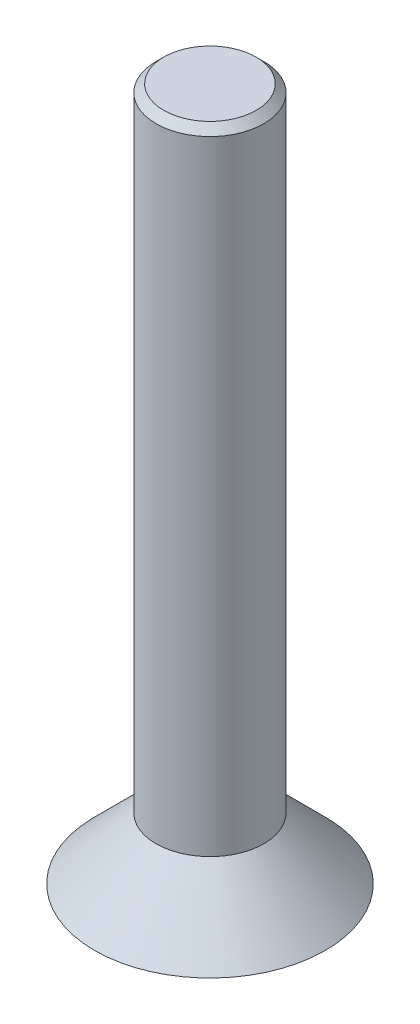
ISO-10303-21;
HEADER;
FILE_DESCRIPTION(('STEP AP214'),'2;1');
FILE_NAME('part.step','',(''),(''),'','','');
FILE_SCHEMA(('AUTOMOTIVE_DESIGN { 1 0 10303 214 1 1 1 1 }'));
ENDSEC;
DATA;
#1=APPLICATION_CONTEXT('core data for automotive mechanical design processes');
#2=APPLICATION_PROTOCOL_DEFINITION('international standard','automotive_design',2000,#1);
#3=PRODUCT_CONTEXT('',#1,'mechanical');
#4=PRODUCT('Part','Part','',(#3));
#5=PRODUCT_RELATED_PRODUCT_CATEGORY('part','',(#4));
#6=PRODUCT_DEFINITION_FORMATION('','',#4);
#7=PRODUCT_DEFINITION_CONTEXT('part definition',#1,'design');
#8=PRODUCT_DEFINITION('design','',#6,#7);
#9=PRODUCT_DEFINITION_SHAPE('','',#8);
#10=(LENGTH_UNIT() NAMED_UNIT(*) SI_UNIT(.MILLI.,.METRE.));
#11=(NAMED_UNIT(*) PLANE_ANGLE_UNIT() SI_UNIT($,.RADIAN.));
#12=(NAMED_UNIT(*) SI_UNIT($,.STERADIAN.) SOLID_ANGLE_UNIT());
#13=UNCERTAINTY_MEASURE_WITH_UNIT(LENGTH_MEASURE(1.E-05),#10,'distance_accuracy_value','');
#14=(GEOMETRIC_REPRESENTATION_CONTEXT(3) GLOBAL_UNCERTAINTY_ASSIGNED_CONTEXT((#13)) GLOBAL_UNIT_ASSIGNED_CONTEXT((#10,
#11,#12)) REPRESENTATION_CONTEXT('',''));
#15=CARTESIAN_POINT('',(0.,0.,0.));
#16=DIRECTION('',(0.,0.,1.));
#17=DIRECTION('',(1.,0.,0.));
#18=AXIS2_PLACEMENT_3D('',#15,#16,#17);
#19=CARTESIAN_POINT('',(0.,0.,0.));
#20=DIRECTION('',(0.,1.,0.));
#21=DIRECTION('',(0.,0.,1.));
#22=AXIS2_PLACEMENT_3D('',#19,#20,#21);
#23=PLANE('',#22);
#24=CARTESIAN_POINT('',(0.,0.,0.));
#25=DIRECTION('',(0.,1.,0.));
#26=DIRECTION('',(0.,0.,1.));
#27=AXIS2_PLACEMENT_3D('',#24,#25,#26);
#28=CIRCLE('',#27,3.);
#29=CARTESIAN_POINT('',(0.,0.,3.));
#30=VERTEX_POINT('',#29);
#31=EDGE_CURVE('E126',#30,#30,#28,.T.);
#32=ORIENTED_EDGE('',*,*,#31,.F.);
#33=EDGE_LOOP('',(#32));
#34=FACE_BOUND('',#33,.T.);
#35=DIRECTION('',(0.866025403784439,0.,0.5));
#36=VECTOR('',#35,1.);
#37=CARTESIAN_POINT('',(-1.,0.,0.577350269189626));
#38=LINE('',#37,#36);
#39=CARTESIAN_POINT('',(-1.,0.,0.577350269189626));
#40=VERTEX_POINT('',#39);
#41=CARTESIAN_POINT('',(0.,0.,1.15470053837925));
#42=VERTEX_POINT('',#41);
#43=EDGE_CURVE('E55',#40,#42,#38,.T.);
#44=ORIENTED_EDGE('',*,*,#43,.T.);
#45=DIRECTION('',(0.866025403784438,0.,-0.5));
#46=VECTOR('',#45,1.);
#47=CARTESIAN_POINT('',(0.,0.,1.15470053837925));
#48=LINE('',#47,#46);
#49=CARTESIAN_POINT('',(1.,0.,0.577350269189626));
#50=VERTEX_POINT('',#49);
#51=EDGE_CURVE('E111',#42,#50,#48,.T.);
#52=ORIENTED_EDGE('',*,*,#51,.T.);
#53=DIRECTION('',(0.,0.,-1.));
#54=VECTOR('',#53,1.);
#55=CARTESIAN_POINT('',(1.,0.,0.577350269189626));
#56=LINE('',#55,#54);
#57=CARTESIAN_POINT('',(0.999999999999999,0.,-0.577350269189626));
#58=VERTEX_POINT('',#57);
#59=EDGE_CURVE('E109',#50,#58,#56,.T.);
#60=ORIENTED_EDGE('',*,*,#59,.T.);
#61=DIRECTION('',(-0.866025403784439,0.,-0.5));
#62=VECTOR('',#61,1.);
#63=CARTESIAN_POINT('',(0.999999999999999,0.,-0.577350269189626));
#64=LINE('',#63,#62);
#65=CARTESIAN_POINT('',(0.,0.,-1.15470053837925));
#66=VERTEX_POINT('',#65);
#67=EDGE_CURVE('E90',#58,#66,#64,.T.);
#68=ORIENTED_EDGE('',*,*,#67,.T.);
#69=DIRECTION('',(-0.866025403784438,0.,0.5));
#70=VECTOR('',#69,1.);
#71=CARTESIAN_POINT('',(0.,0.,-1.15470053837925));
#72=LINE('',#71,#70);
#73=CARTESIAN_POINT('',(-1.,0.,-0.577350269189625));
#74=VERTEX_POINT('',#73);
#75=EDGE_CURVE('E99',#66,#74,#72,.T.);
#76=ORIENTED_EDGE('',*,*,#75,.T.);
#77=DIRECTION('',(0.,0.,1.));
#78=VECTOR('',#77,1.);
#79=CARTESIAN_POINT('',(-1.,0.,-0.577350269189625));
#80=LINE('',#79,#78);
#81=EDGE_CURVE('E105',#74,#40,#80,.T.);
#82=ORIENTED_EDGE('',*,*,#81,.T.);
#83=EDGE_LOOP('',(#44,#52,#60,#68,#76,#82));
#84=FACE_BOUND('',#83,.T.);
#85=ADVANCED_FACE('F39',(#34,#84),#23,.F.);
#86=CARTESIAN_POINT('',(-1.,1.6,0.577350269189626));
#87=DIRECTION('',(0.5,0.,-0.866025403784439));
#88=DIRECTION('',(-0.866025403784439,0.,-0.5));
#89=AXIS2_PLACEMENT_3D('',#86,#87,#88);
#90=PLANE('',#89);
#91=ORIENTED_EDGE('',*,*,#43,.F.);
#92=DIRECTION('',(0.,-1.,0.));
#93=VECTOR('',#92,1.);
#94=CARTESIAN_POINT('',(-1.,1.6,0.577350269189626));
#95=LINE('',#94,#93);
#96=CARTESIAN_POINT('',(-1.,1.6,0.577350269189626));
#97=VERTEX_POINT('',#96);
#98=EDGE_CURVE('E117',#97,#40,#95,.T.);
#99=ORIENTED_EDGE('',*,*,#98,.F.);
#100=DIRECTION('',(0.866025403784439,0.,0.5));
#101=VECTOR('',#100,1.);
#102=CARTESIAN_POINT('',(-1.,1.6,0.577350269189626));
#103=LINE('',#102,#101);
#104=CARTESIAN_POINT('',(0.,1.6,1.15470053837925));
#105=VERTEX_POINT('',#104);
#106=EDGE_CURVE('E116',#97,#105,#103,.T.);
#107=ORIENTED_EDGE('',*,*,#106,.T.);
#108=DIRECTION('',(0.,-1.,0.));
#109=VECTOR('',#108,1.);
#110=CARTESIAN_POINT('',(0.,1.6,1.15470053837925));
#111=LINE('',#110,#109);
#112=EDGE_CURVE('E124',#105,#42,#111,.T.);
#113=ORIENTED_EDGE('',*,*,#112,.T.);
#114=EDGE_LOOP('',(#91,#99,#107,#113));
#115=FACE_BOUND('',#114,.T.);
#116=ADVANCED_FACE('F145',(#115),#90,.T.);
#117=CARTESIAN_POINT('',(0.,1.6,1.15470053837925));
#118=DIRECTION('',(-0.5,0.,-0.866025403784438));
#119=DIRECTION('',(-0.866025403784439,0.,0.5));
#120=AXIS2_PLACEMENT_3D('',#117,#118,#119);
#121=PLANE('',#120);
#122=ORIENTED_EDGE('',*,*,#51,.F.);
#123=ORIENTED_EDGE('',*,*,#112,.F.);
#124=DIRECTION('',(0.866025403784438,0.,-0.5));
#125=VECTOR('',#124,1.);
#126=CARTESIAN_POINT('',(0.,1.6,1.15470053837925));
#127=LINE('',#126,#125);
#128=CARTESIAN_POINT('',(1.,1.6,0.577350269189626));
#129=VERTEX_POINT('',#128);
#130=EDGE_CURVE('E204',#105,#129,#127,.T.);
#131=ORIENTED_EDGE('',*,*,#130,.T.);
#132=DIRECTION('',(0.,-1.,0.));
#133=VECTOR('',#132,1.);
#134=CARTESIAN_POINT('',(1.,1.6,0.577350269189626));
#135=LINE('',#134,#133);
#136=EDGE_CURVE('E122',#129,#50,#135,.T.);
#137=ORIENTED_EDGE('',*,*,#136,.T.);
#138=EDGE_LOOP('',(#122,#123,#131,#137));
#139=FACE_BOUND('',#138,.T.);
#140=ADVANCED_FACE('F151',(#139),#121,.T.);
#141=CARTESIAN_POINT('',(1.,1.6,0.577350269189626));
#142=DIRECTION('',(-1.,0.,0.));
#143=DIRECTION('',(0.,0.,1.));
#144=AXIS2_PLACEMENT_3D('',#141,#142,#143);
#145=PLANE('',#144);
#146=ORIENTED_EDGE('',*,*,#59,.F.);
#147=ORIENTED_EDGE('',*,*,#136,.F.);
#148=DIRECTION('',(0.,0.,-1.));
#149=VECTOR('',#148,1.);
#150=CARTESIAN_POINT('',(1.,1.6,0.577350269189626));
#151=LINE('',#150,#149);
#152=CARTESIAN_POINT('',(0.999999999999999,1.6,-0.577350269189626));
#153=VERTEX_POINT('',#152);
#154=EDGE_CURVE('E202',#129,#153,#151,.T.);
#155=ORIENTED_EDGE('',*,*,#154,.T.);
#156=DIRECTION('',(0.,-1.,0.));
#157=VECTOR('',#156,1.);
#158=CARTESIAN_POINT('',(0.999999999999999,1.6,-0.577350269189626));
#159=LINE('',#158,#157);
#160=EDGE_CURVE('E95',#153,#58,#159,.T.);
#161=ORIENTED_EDGE('',*,*,#160,.T.);
#162=EDGE_LOOP('',(#146,#147,#155,#161));
#163=FACE_BOUND('',#162,.T.);
#164=ADVANCED_FACE('F183',(#163),#145,.T.);
#165=CARTESIAN_POINT('',(0.999999999999999,1.6,-0.577350269189626));
#166=DIRECTION('',(-0.5,0.,0.866025403784439));
#167=DIRECTION('',(0.866025403784439,0.,0.5));
#168=AXIS2_PLACEMENT_3D('',#165,#166,#167);
#169=PLANE('',#168);
#170=ORIENTED_EDGE('',*,*,#67,.F.);
#171=ORIENTED_EDGE('',*,*,#160,.F.);
#172=DIRECTION('',(-0.866025403784439,0.,-0.5));
#173=VECTOR('',#172,1.);
#174=CARTESIAN_POINT('',(0.999999999999999,1.6,-0.577350269189626));
#175=LINE('',#174,#173);
#176=CARTESIAN_POINT('',(0.,1.6,-1.15470053837925));
#177=VERTEX_POINT('',#176);
#178=EDGE_CURVE('E64',#153,#177,#175,.T.);
#179=ORIENTED_EDGE('',*,*,#178,.T.);
#180=DIRECTION('',(0.,-1.,0.));
#181=VECTOR('',#180,1.);
#182=CARTESIAN_POINT('',(0.,1.6,-1.15470053837925));
#183=LINE('',#182,#181);
#184=EDGE_CURVE('E85',#177,#66,#183,.T.);
#185=ORIENTED_EDGE('',*,*,#184,.T.);
#186=EDGE_LOOP('',(#170,#171,#179,#185));
#187=FACE_BOUND('',#186,.T.);
#188=ADVANCED_FACE('F87',(#187),#169,.T.);
#189=CARTESIAN_POINT('',(0.,1.6,-1.15470053837925));
#190=DIRECTION('',(0.5,0.,0.866025403784438));
#191=DIRECTION('',(0.866025403784439,0.,-0.5));
#192=AXIS2_PLACEMENT_3D('',#189,#190,#191);
#193=PLANE('',#192);
#194=ORIENTED_EDGE('',*,*,#75,.F.);
#195=ORIENTED_EDGE('',*,*,#184,.F.);
#196=DIRECTION('',(-0.866025403784438,0.,0.5));
#197=VECTOR('',#196,1.);
#198=CARTESIAN_POINT('',(0.,1.6,-1.15470053837925));
#199=LINE('',#198,#197);
#200=CARTESIAN_POINT('',(-1.,1.6,-0.577350269189625));
#201=VERTEX_POINT('',#200);
#202=EDGE_CURVE('E199',#177,#201,#199,.T.);
#203=ORIENTED_EDGE('',*,*,#202,.T.);
#204=DIRECTION('',(0.,-1.,0.));
#205=VECTOR('',#204,1.);
#206=CARTESIAN_POINT('',(-1.,1.6,-0.577350269189625));
#207=LINE('',#206,#205);
#208=EDGE_CURVE('E96',#201,#74,#207,.T.);
#209=ORIENTED_EDGE('',*,*,#208,.T.);
#210=EDGE_LOOP('',(#194,#195,#203,#209));
#211=FACE_BOUND('',#210,.T.);
#212=ADVANCED_FACE('F100',(#211),#193,.T.);
#213=CARTESIAN_POINT('',(-1.,1.6,-0.577350269189625));
#214=DIRECTION('',(1.,0.,0.));
#215=DIRECTION('',(0.,0.,-1.));
#216=AXIS2_PLACEMENT_3D('',#213,#214,#215);
#217=PLANE('',#216);
#218=ORIENTED_EDGE('',*,*,#81,.F.);
#219=ORIENTED_EDGE('',*,*,#208,.F.);
#220=DIRECTION('',(0.,0.,1.));
#221=VECTOR('',#220,1.);
#222=CARTESIAN_POINT('',(-1.,1.6,-0.577350269189625));
#223=LINE('',#222,#221);
#224=EDGE_CURVE('E119',#201,#97,#223,.T.);
#225=ORIENTED_EDGE('',*,*,#224,.T.);
#226=ORIENTED_EDGE('',*,*,#98,.T.);
#227=EDGE_LOOP('',(#218,#219,#225,#226));
#228=FACE_BOUND('',#227,.T.);
#229=ADVANCED_FACE('F161',(#228),#217,.T.);
#230=CARTESIAN_POINT('',(0.,1.6,0.));
#231=DIRECTION('',(0.,-1.,0.));
#232=DIRECTION('',(0.,0.,-1.));
#233=AXIS2_PLACEMENT_3D('',#230,#231,#232);
#234=CONICAL_SURFACE('',#233,1.4,0.785398163397447);
#235=ORIENTED_EDGE('',*,*,#31,.T.);
#236=EDGE_LOOP('',(#235));
#237=FACE_BOUND('',#236,.T.);
#238=CARTESIAN_POINT('',(0.,1.6,0.));
#239=DIRECTION('',(0.,1.,0.));
#240=DIRECTION('',(0.,0.,1.));
#241=AXIS2_PLACEMENT_3D('',#238,#239,#240);
#242=CIRCLE('',#241,1.4);
#243=CARTESIAN_POINT('',(0.,1.6,1.4));
#244=VERTEX_POINT('',#243);
#245=EDGE_CURVE('E129',#244,#244,#242,.T.);
#246=ORIENTED_EDGE('',*,*,#245,.F.);
#247=EDGE_LOOP('',(#246));
#248=FACE_BOUND('',#247,.T.);
#249=ADVANCED_FACE('F156',(#237,#248),#234,.T.);
#250=CARTESIAN_POINT('',(0.,1.6,0.));
#251=DIRECTION('',(0.,1.,0.));
#252=DIRECTION('',(0.,0.,1.));
#253=AXIS2_PLACEMENT_3D('',#250,#251,#252);
#254=PLANE('',#253);
#255=ORIENTED_EDGE('',*,*,#130,.F.);
#256=ORIENTED_EDGE('',*,*,#106,.F.);
#257=ORIENTED_EDGE('',*,*,#224,.F.);
#258=ORIENTED_EDGE('',*,*,#202,.F.);
#259=ORIENTED_EDGE('',*,*,#178,.F.);
#260=ORIENTED_EDGE('',*,*,#154,.F.);
#261=EDGE_LOOP('',(#255,#256,#257,#258,#259,#260));
#262=FACE_BOUND('',#261,.T.);
#263=ADVANCED_FACE('F160',(#262),#254,.F.);
#264=CARTESIAN_POINT('',(0.,18.,0.));
#265=DIRECTION('',(0.,-1.,0.));
#266=DIRECTION('',(0.,0.,-1.));
#267=AXIS2_PLACEMENT_3D('',#264,#265,#266);
#268=CYLINDRICAL_SURFACE('',#267,1.4);
#269=CARTESIAN_POINT('',(0.,17.8,0.));
#270=DIRECTION('',(0.,1.,0.));
#271=DIRECTION('',(0.,0.,1.));
#272=AXIS2_PLACEMENT_3D('',#269,#270,#271);
#273=CIRCLE('',#272,1.4);
#274=CARTESIAN_POINT('',(0.,17.8,1.4));
#275=VERTEX_POINT('',#274);
#276=EDGE_CURVE('E11',#275,#275,#273,.F.);
#277=ORIENTED_EDGE('',*,*,#276,.T.);
#278=EDGE_LOOP('',(#277));
#279=FACE_BOUND('',#278,.T.);
#280=ORIENTED_EDGE('',*,*,#245,.T.);
#281=EDGE_LOOP('',(#280));
#282=FACE_BOUND('',#281,.T.);
#283=ADVANCED_FACE('F141',(#279,#282),#268,.T.);
#284=CARTESIAN_POINT('',(0.,18.,0.));
#285=DIRECTION('',(0.,1.,0.));
#286=DIRECTION('',(0.,0.,1.));
#287=AXIS2_PLACEMENT_3D('',#284,#285,#286);
#288=PLANE('',#287);
#289=CARTESIAN_POINT('',(0.,18.,0.));
#290=DIRECTION('',(0.,1.,0.));
#291=DIRECTION('',(0.,0.,1.));
#292=AXIS2_PLACEMENT_3D('',#289,#290,#291);
#293=CIRCLE('',#292,1.2);
#294=CARTESIAN_POINT('',(0.,18.,1.2));
#295=VERTEX_POINT('',#294);
#296=EDGE_CURVE('E48',#295,#295,#293,.T.);
#297=ORIENTED_EDGE('',*,*,#296,.T.);
#298=EDGE_LOOP('',(#297));
#299=FACE_BOUND('',#298,.T.);
#300=ADVANCED_FACE('F134',(#299),#288,.T.);
#301=CARTESIAN_POINT('',(0.,18.,0.));
#302=DIRECTION('',(0.,-1.,0.));
#303=DIRECTION('',(0.,0.,-1.));
#304=AXIS2_PLACEMENT_3D('',#301,#302,#303);
#305=CONICAL_SURFACE('',#304,1.2,0.785398163397448);
#306=ORIENTED_EDGE('',*,*,#276,.F.);
#307=EDGE_LOOP('',(#306));
#308=FACE_BOUND('',#307,.T.);
#309=ORIENTED_EDGE('',*,*,#296,.F.);
#310=EDGE_LOOP('',(#309));
#311=FACE_BOUND('',#310,.T.);
#312=ADVANCED_FACE('F42',(#308,#311),#305,.T.);
#313=CLOSED_SHELL('',(#85,#116,#140,#164,#188,#212,#229,#249,#263,#283,#300,#312));
#314=MANIFOLD_SOLID_BREP('B2',#313);
#315=ADVANCED_BREP_SHAPE_REPRESENTATION('',(#18,#314),#14);
#316=SHAPE_DEFINITION_REPRESENTATION(#9,#315);
ENDSEC;
END-ISO-10303-21;
